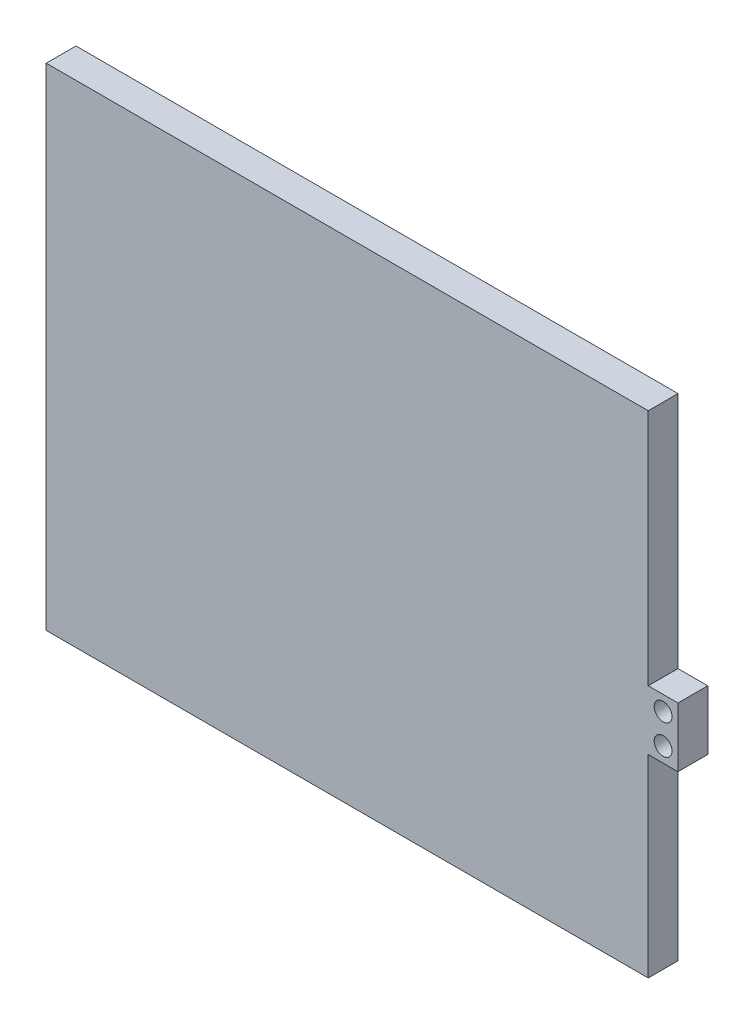
ISO-10303-21;
HEADER;
FILE_DESCRIPTION(('STEP AP214'),'2;1');
FILE_NAME('part.step','',(''),(''),'','','');
FILE_SCHEMA(('AUTOMOTIVE_DESIGN { 1 0 10303 214 1 1 1 1 }'));
ENDSEC;
DATA;
#1=APPLICATION_CONTEXT('core data for automotive mechanical design processes');
#2=APPLICATION_PROTOCOL_DEFINITION('international standard','automotive_design',2000,#1);
#3=PRODUCT_CONTEXT('',#1,'mechanical');
#4=PRODUCT('Part','Part','',(#3));
#5=PRODUCT_RELATED_PRODUCT_CATEGORY('part','',(#4));
#6=PRODUCT_DEFINITION_FORMATION('','',#4);
#7=PRODUCT_DEFINITION_CONTEXT('part definition',#1,'design');
#8=PRODUCT_DEFINITION('design','',#6,#7);
#9=PRODUCT_DEFINITION_SHAPE('','',#8);
#10=(LENGTH_UNIT() NAMED_UNIT(*) SI_UNIT(.MILLI.,.METRE.));
#11=(NAMED_UNIT(*) PLANE_ANGLE_UNIT() SI_UNIT($,.RADIAN.));
#12=(NAMED_UNIT(*) SI_UNIT($,.STERADIAN.) SOLID_ANGLE_UNIT());
#13=UNCERTAINTY_MEASURE_WITH_UNIT(LENGTH_MEASURE(1.E-05),#10,'distance_accuracy_value','');
#14=(GEOMETRIC_REPRESENTATION_CONTEXT(3) GLOBAL_UNCERTAINTY_ASSIGNED_CONTEXT((#13)) GLOBAL_UNIT_ASSIGNED_CONTEXT((#10,
#11,#12)) REPRESENTATION_CONTEXT('',''));
#15=CARTESIAN_POINT('',(0.,0.,0.));
#16=DIRECTION('',(0.,0.,1.));
#17=DIRECTION('',(1.,0.,0.));
#18=AXIS2_PLACEMENT_3D('',#15,#16,#17);
#19=CARTESIAN_POINT('',(134.372438209087,87.1772870662461,12.7));
#20=DIRECTION('',(-1.,0.,0.));
#21=DIRECTION('',(0.,0.,1.));
#22=AXIS2_PLACEMENT_3D('',#19,#20,#21);
#23=PLANE('',#22);
#24=DIRECTION('',(0.,0.,1.));
#25=VECTOR('',#24,1.);
#26=CARTESIAN_POINT('',(134.372438209087,-1.72271293375394,12.7));
#27=LINE('',#26,#25);
#28=CARTESIAN_POINT('',(134.372438209087,-1.72271293375394,0.));
#29=VERTEX_POINT('',#28);
#30=CARTESIAN_POINT('',(134.372438209087,-1.72271293375394,12.7));
#31=VERTEX_POINT('',#30);
#32=EDGE_CURVE('E147',#29,#31,#27,.T.);
#33=ORIENTED_EDGE('',*,*,#32,.F.);
#34=DIRECTION('',(0.,1.,0.));
#35=VECTOR('',#34,1.);
#36=CARTESIAN_POINT('',(134.372438209087,87.1772870662461,0.));
#37=LINE('',#36,#35);
#38=CARTESIAN_POINT('',(134.372438209087,99.8772870662461,0.));
#39=VERTEX_POINT('',#38);
#40=EDGE_CURVE('E173',#29,#39,#37,.T.);
#41=ORIENTED_EDGE('',*,*,#40,.T.);
#42=DIRECTION('',(0.,0.,-1.));
#43=VECTOR('',#42,1.);
#44=CARTESIAN_POINT('',(134.372438209087,99.8772870662461,0.));
#45=LINE('',#44,#43);
#46=CARTESIAN_POINT('',(134.372438209087,99.8772870662461,12.7));
#47=VERTEX_POINT('',#46);
#48=EDGE_CURVE('E121',#47,#39,#45,.T.);
#49=ORIENTED_EDGE('',*,*,#48,.F.);
#50=DIRECTION('',(0.,1.,0.));
#51=VECTOR('',#50,1.);
#52=CARTESIAN_POINT('',(134.372438209087,87.1772870662461,12.7));
#53=LINE('',#52,#51);
#54=EDGE_CURVE('E54',#31,#47,#53,.T.);
#55=ORIENTED_EDGE('',*,*,#54,.F.);
#56=EDGE_LOOP('',(#33,#41,#49,#55));
#57=FACE_BOUND('',#56,.T.);
#58=ADVANCED_FACE('F39',(#57),#23,.F.);
#59=DIRECTION('',(0.,0.,-1.));
#60=VECTOR('',#59,1.);
#61=CARTESIAN_POINT('',(134.372438209087,-27.1227129337539,12.7));
#62=LINE('',#61,#60);
#63=CARTESIAN_POINT('',(134.372438209087,-27.1227129337539,12.7));
#64=VERTEX_POINT('',#63);
#65=CARTESIAN_POINT('',(134.372438209087,-27.1227129337539,0.));
#66=VERTEX_POINT('',#65);
#67=EDGE_CURVE('E62',#64,#66,#62,.T.);
#68=ORIENTED_EDGE('',*,*,#67,.F.);
#69=CARTESIAN_POINT('',(134.372438209087,-109.672712933754,12.7));
#70=VERTEX_POINT('',#69);
#71=EDGE_CURVE('E168',#70,#64,#53,.T.);
#72=ORIENTED_EDGE('',*,*,#71,.F.);
#73=DIRECTION('',(0.,0.,-1.));
#74=VECTOR('',#73,1.);
#75=CARTESIAN_POINT('',(134.372438209087,-109.672712933754,12.7));
#76=LINE('',#75,#74);
#77=CARTESIAN_POINT('',(134.372438209087,-109.672712933754,0.));
#78=VERTEX_POINT('',#77);
#79=EDGE_CURVE('E47',#70,#78,#76,.T.);
#80=ORIENTED_EDGE('',*,*,#79,.T.);
#81=EDGE_CURVE('E113',#78,#66,#37,.T.);
#82=ORIENTED_EDGE('',*,*,#81,.T.);
#83=EDGE_LOOP('',(#68,#72,#80,#82));
#84=FACE_BOUND('',#83,.T.);
#85=ADVANCED_FACE('F177',(#84),#23,.F.);
#86=CARTESIAN_POINT('',(-122.421561790913,87.1772870662461,12.7));
#87=DIRECTION('',(1.,0.,0.));
#88=DIRECTION('',(0.,1.,0.));
#89=AXIS2_PLACEMENT_3D('',#86,#87,#88);
#90=PLANE('',#89);
#91=DIRECTION('',(0.,-1.,0.));
#92=VECTOR('',#91,1.);
#93=CARTESIAN_POINT('',(-122.421561790913,87.1772870662461,0.));
#94=LINE('',#93,#92);
#95=CARTESIAN_POINT('',(-122.421561790913,99.8772870662461,0.));
#96=VERTEX_POINT('',#95);
#97=CARTESIAN_POINT('',(-122.421561790913,-109.672712933754,0.));
#98=VERTEX_POINT('',#97);
#99=EDGE_CURVE('E165',#96,#98,#94,.T.);
#100=ORIENTED_EDGE('',*,*,#99,.T.);
#101=DIRECTION('',(0.,0.,-1.));
#102=VECTOR('',#101,1.);
#103=CARTESIAN_POINT('',(-122.421561790913,-109.672712933754,12.7));
#104=LINE('',#103,#102);
#105=CARTESIAN_POINT('',(-122.421561790913,-109.672712933754,12.7));
#106=VERTEX_POINT('',#105);
#107=EDGE_CURVE('E11',#106,#98,#104,.T.);
#108=ORIENTED_EDGE('',*,*,#107,.F.);
#109=DIRECTION('',(0.,-1.,0.));
#110=VECTOR('',#109,1.);
#111=CARTESIAN_POINT('',(-122.421561790913,87.1772870662461,12.7));
#112=LINE('',#111,#110);
#113=CARTESIAN_POINT('',(-122.421561790913,99.8772870662461,12.7));
#114=VERTEX_POINT('',#113);
#115=EDGE_CURVE('E106',#114,#106,#112,.T.);
#116=ORIENTED_EDGE('',*,*,#115,.F.);
#117=DIRECTION('',(0.,0.,1.));
#118=VECTOR('',#117,1.);
#119=CARTESIAN_POINT('',(-122.421561790913,99.8772870662461,0.));
#120=LINE('',#119,#118);
#121=EDGE_CURVE('E110',#96,#114,#120,.T.);
#122=ORIENTED_EDGE('',*,*,#121,.F.);
#123=EDGE_LOOP('',(#100,#108,#116,#122));
#124=FACE_BOUND('',#123,.T.);
#125=ADVANCED_FACE('F41',(#124),#90,.F.);
#126=CARTESIAN_POINT('',(-122.421561790913,-109.672712933754,12.7));
#127=DIRECTION('',(0.,1.,0.));
#128=DIRECTION('',(0.,0.,1.));
#129=AXIS2_PLACEMENT_3D('',#126,#127,#128);
#130=PLANE('',#129);
#131=DIRECTION('',(1.,0.,0.));
#132=VECTOR('',#131,1.);
#133=CARTESIAN_POINT('',(-122.421561790913,-109.672712933754,0.));
#134=LINE('',#133,#132);
#135=EDGE_CURVE('E171',#98,#78,#134,.T.);
#136=ORIENTED_EDGE('',*,*,#135,.T.);
#137=ORIENTED_EDGE('',*,*,#79,.F.);
#138=DIRECTION('',(1.,0.,0.));
#139=VECTOR('',#138,1.);
#140=CARTESIAN_POINT('',(-122.421561790913,-109.672712933754,12.7));
#141=LINE('',#140,#139);
#142=EDGE_CURVE('E112',#106,#70,#141,.T.);
#143=ORIENTED_EDGE('',*,*,#142,.F.);
#144=ORIENTED_EDGE('',*,*,#107,.T.);
#145=EDGE_LOOP('',(#136,#137,#143,#144));
#146=FACE_BOUND('',#145,.T.);
#147=ADVANCED_FACE('F188',(#146),#130,.F.);
#148=CARTESIAN_POINT('',(0.,0.,12.7));
#149=DIRECTION('',(0.,0.,1.));
#150=DIRECTION('',(1.,0.,0.));
#151=AXIS2_PLACEMENT_3D('',#148,#149,#150);
#152=PLANE('',#151);
#153=CARTESIAN_POINT('',(140.722438209087,-8.07271293375394,12.7));
#154=DIRECTION('',(0.,0.,-1.));
#155=DIRECTION('',(-1.,0.,0.));
#156=AXIS2_PLACEMENT_3D('',#153,#154,#155);
#157=CIRCLE('',#156,3.81000000000001);
#158=CARTESIAN_POINT('',(136.912438209087,-8.07271293375394,12.7));
#159=VERTEX_POINT('',#158);
#160=EDGE_CURVE('E132',#159,#159,#157,.T.);
#161=ORIENTED_EDGE('',*,*,#160,.T.);
#162=EDGE_LOOP('',(#161));
#163=FACE_BOUND('',#162,.T.);
#164=CARTESIAN_POINT('',(140.722438209087,-20.7727129337539,12.7));
#165=DIRECTION('',(0.,0.,-1.));
#166=DIRECTION('',(-1.,0.,0.));
#167=AXIS2_PLACEMENT_3D('',#164,#165,#166);
#168=CIRCLE('',#167,3.81000000000001);
#169=CARTESIAN_POINT('',(136.912438209087,-20.7727129337539,12.7));
#170=VERTEX_POINT('',#169);
#171=EDGE_CURVE('E131',#170,#170,#168,.T.);
#172=ORIENTED_EDGE('',*,*,#171,.T.);
#173=EDGE_LOOP('',(#172));
#174=FACE_BOUND('',#173,.T.);
#175=ORIENTED_EDGE('',*,*,#115,.T.);
#176=ORIENTED_EDGE('',*,*,#142,.T.);
#177=ORIENTED_EDGE('',*,*,#71,.T.);
#178=DIRECTION('',(-1.,0.,0.));
#179=VECTOR('',#178,1.);
#180=CARTESIAN_POINT('',(147.072438209087,-27.1227129337539,12.7));
#181=LINE('',#180,#179);
#182=CARTESIAN_POINT('',(147.072438209087,-27.1227129337539,12.7));
#183=VERTEX_POINT('',#182);
#184=EDGE_CURVE('E163',#183,#64,#181,.T.);
#185=ORIENTED_EDGE('',*,*,#184,.F.);
#186=DIRECTION('',(0.,-1.,0.));
#187=VECTOR('',#186,1.);
#188=CARTESIAN_POINT('',(147.072438209087,-1.72271293375394,12.7));
#189=LINE('',#188,#187);
#190=CARTESIAN_POINT('',(147.072438209087,-1.72271293375394,12.7));
#191=VERTEX_POINT('',#190);
#192=EDGE_CURVE('E143',#191,#183,#189,.T.);
#193=ORIENTED_EDGE('',*,*,#192,.F.);
#194=DIRECTION('',(-1.,0.,0.));
#195=VECTOR('',#194,1.);
#196=CARTESIAN_POINT('',(147.072438209087,-1.72271293375394,12.7));
#197=LINE('',#196,#195);
#198=EDGE_CURVE('E153',#191,#31,#197,.T.);
#199=ORIENTED_EDGE('',*,*,#198,.T.);
#200=ORIENTED_EDGE('',*,*,#54,.T.);
#201=DIRECTION('',(1.,0.,0.));
#202=VECTOR('',#201,1.);
#203=CARTESIAN_POINT('',(-122.421561790913,99.8772870662461,12.7));
#204=LINE('',#203,#202);
#205=EDGE_CURVE('E116',#114,#47,#204,.T.);
#206=ORIENTED_EDGE('',*,*,#205,.F.);
#207=EDGE_LOOP('',(#175,#176,#177,#185,#193,#199,#200,#206));
#208=FACE_BOUND('',#207,.T.);
#209=ADVANCED_FACE('F117',(#163,#174,#208),#152,.T.);
#210=CARTESIAN_POINT('',(0.,0.,0.));
#211=DIRECTION('',(0.,0.,1.));
#212=DIRECTION('',(1.,0.,0.));
#213=AXIS2_PLACEMENT_3D('',#210,#211,#212);
#214=PLANE('',#213);
#215=CARTESIAN_POINT('',(140.722438209087,-8.07271293375394,0.));
#216=DIRECTION('',(0.,0.,-1.));
#217=DIRECTION('',(-1.,0.,0.));
#218=AXIS2_PLACEMENT_3D('',#215,#216,#217);
#219=CIRCLE('',#218,3.81000000000001);
#220=CARTESIAN_POINT('',(136.912438209087,-8.07271293375394,0.));
#221=VERTEX_POINT('',#220);
#222=EDGE_CURVE('E135',#221,#221,#219,.T.);
#223=ORIENTED_EDGE('',*,*,#222,.F.);
#224=EDGE_LOOP('',(#223));
#225=FACE_BOUND('',#224,.T.);
#226=CARTESIAN_POINT('',(140.722438209087,-20.7727129337539,0.));
#227=DIRECTION('',(0.,0.,-1.));
#228=DIRECTION('',(-1.,0.,0.));
#229=AXIS2_PLACEMENT_3D('',#226,#227,#228);
#230=CIRCLE('',#229,3.81000000000001);
#231=CARTESIAN_POINT('',(136.912438209087,-20.7727129337539,0.));
#232=VERTEX_POINT('',#231);
#233=EDGE_CURVE('E138',#232,#232,#230,.T.);
#234=ORIENTED_EDGE('',*,*,#233,.F.);
#235=EDGE_LOOP('',(#234));
#236=FACE_BOUND('',#235,.T.);
#237=ORIENTED_EDGE('',*,*,#99,.F.);
#238=DIRECTION('',(-1.,0.,0.));
#239=VECTOR('',#238,1.);
#240=CARTESIAN_POINT('',(-122.421561790913,99.8772870662461,0.));
#241=LINE('',#240,#239);
#242=EDGE_CURVE('E126',#39,#96,#241,.T.);
#243=ORIENTED_EDGE('',*,*,#242,.F.);
#244=ORIENTED_EDGE('',*,*,#40,.F.);
#245=DIRECTION('',(-1.,0.,0.));
#246=VECTOR('',#245,1.);
#247=CARTESIAN_POINT('',(147.072438209087,-1.72271293375394,0.));
#248=LINE('',#247,#246);
#249=CARTESIAN_POINT('',(147.072438209087,-1.72271293375394,0.));
#250=VERTEX_POINT('',#249);
#251=EDGE_CURVE('E157',#250,#29,#248,.T.);
#252=ORIENTED_EDGE('',*,*,#251,.F.);
#253=DIRECTION('',(0.,1.,0.));
#254=VECTOR('',#253,1.);
#255=CARTESIAN_POINT('',(147.072438209087,-1.72271293375394,0.));
#256=LINE('',#255,#254);
#257=CARTESIAN_POINT('',(147.072438209087,-27.1227129337539,0.));
#258=VERTEX_POINT('',#257);
#259=EDGE_CURVE('E149',#258,#250,#256,.T.);
#260=ORIENTED_EDGE('',*,*,#259,.F.);
#261=DIRECTION('',(-1.,0.,0.));
#262=VECTOR('',#261,1.);
#263=CARTESIAN_POINT('',(147.072438209087,-27.1227129337539,0.));
#264=LINE('',#263,#262);
#265=EDGE_CURVE('E160',#258,#66,#264,.T.);
#266=ORIENTED_EDGE('',*,*,#265,.T.);
#267=ORIENTED_EDGE('',*,*,#81,.F.);
#268=ORIENTED_EDGE('',*,*,#135,.F.);
#269=EDGE_LOOP('',(#237,#243,#244,#252,#260,#266,#267,#268));
#270=FACE_BOUND('',#269,.T.);
#271=ADVANCED_FACE('F180',(#225,#236,#270),#214,.F.);
#272=CARTESIAN_POINT('',(147.072438209087,-27.1227129337539,12.7));
#273=DIRECTION('',(0.,1.,0.));
#274=DIRECTION('',(0.,0.,1.));
#275=AXIS2_PLACEMENT_3D('',#272,#273,#274);
#276=PLANE('',#275);
#277=ORIENTED_EDGE('',*,*,#67,.T.);
#278=ORIENTED_EDGE('',*,*,#265,.F.);
#279=DIRECTION('',(0.,0.,-1.));
#280=VECTOR('',#279,1.);
#281=CARTESIAN_POINT('',(147.072438209087,-27.1227129337539,12.7));
#282=LINE('',#281,#280);
#283=EDGE_CURVE('E146',#183,#258,#282,.T.);
#284=ORIENTED_EDGE('',*,*,#283,.F.);
#285=ORIENTED_EDGE('',*,*,#184,.T.);
#286=EDGE_LOOP('',(#277,#278,#284,#285));
#287=FACE_BOUND('',#286,.T.);
#288=ADVANCED_FACE('F185',(#287),#276,.F.);
#289=CARTESIAN_POINT('',(147.072438209087,-1.72271293375394,12.7));
#290=DIRECTION('',(0.,-1.,0.));
#291=DIRECTION('',(0.,0.,-1.));
#292=AXIS2_PLACEMENT_3D('',#289,#290,#291);
#293=PLANE('',#292);
#294=ORIENTED_EDGE('',*,*,#32,.T.);
#295=ORIENTED_EDGE('',*,*,#198,.F.);
#296=DIRECTION('',(0.,0.,1.));
#297=VECTOR('',#296,1.);
#298=CARTESIAN_POINT('',(147.072438209087,-1.72271293375394,12.7));
#299=LINE('',#298,#297);
#300=EDGE_CURVE('E151',#250,#191,#299,.T.);
#301=ORIENTED_EDGE('',*,*,#300,.F.);
#302=ORIENTED_EDGE('',*,*,#251,.T.);
#303=EDGE_LOOP('',(#294,#295,#301,#302));
#304=FACE_BOUND('',#303,.T.);
#305=ADVANCED_FACE('F192',(#304),#293,.F.);
#306=CARTESIAN_POINT('',(147.072438209087,0.,0.));
#307=DIRECTION('',(1.,0.,0.));
#308=DIRECTION('',(0.,0.,-1.));
#309=AXIS2_PLACEMENT_3D('',#306,#307,#308);
#310=PLANE('',#309);
#311=ORIENTED_EDGE('',*,*,#192,.T.);
#312=ORIENTED_EDGE('',*,*,#283,.T.);
#313=ORIENTED_EDGE('',*,*,#259,.T.);
#314=ORIENTED_EDGE('',*,*,#300,.T.);
#315=EDGE_LOOP('',(#311,#312,#313,#314));
#316=FACE_BOUND('',#315,.T.);
#317=ADVANCED_FACE('F195',(#316),#310,.T.);
#318=CARTESIAN_POINT('',(140.722438209087,-20.7727129337539,12.7));
#319=DIRECTION('',(0.,0.,-1.));
#320=DIRECTION('',(-1.,0.,0.));
#321=AXIS2_PLACEMENT_3D('',#318,#319,#320);
#322=CYLINDRICAL_SURFACE('',#321,3.81000000000001);
#323=ORIENTED_EDGE('',*,*,#171,.F.);
#324=EDGE_LOOP('',(#323));
#325=FACE_BOUND('',#324,.T.);
#326=ORIENTED_EDGE('',*,*,#233,.T.);
#327=EDGE_LOOP('',(#326));
#328=FACE_BOUND('',#327,.T.);
#329=ADVANCED_FACE('F197',(#325,#328),#322,.F.);
#330=CARTESIAN_POINT('',(140.722438209087,-8.07271293375394,12.7));
#331=DIRECTION('',(0.,0.,-1.));
#332=DIRECTION('',(-1.,0.,0.));
#333=AXIS2_PLACEMENT_3D('',#330,#331,#332);
#334=CYLINDRICAL_SURFACE('',#333,3.81000000000001);
#335=ORIENTED_EDGE('',*,*,#160,.F.);
#336=EDGE_LOOP('',(#335));
#337=FACE_BOUND('',#336,.T.);
#338=ORIENTED_EDGE('',*,*,#222,.T.);
#339=EDGE_LOOP('',(#338));
#340=FACE_BOUND('',#339,.T.);
#341=ADVANCED_FACE('F203',(#337,#340),#334,.F.);
#342=CARTESIAN_POINT('',(0.,99.8772870662461,0.));
#343=DIRECTION('',(0.,1.,0.));
#344=DIRECTION('',(0.,0.,1.));
#345=AXIS2_PLACEMENT_3D('',#342,#343,#344);
#346=PLANE('',#345);
#347=ORIENTED_EDGE('',*,*,#121,.T.);
#348=ORIENTED_EDGE('',*,*,#205,.T.);
#349=ORIENTED_EDGE('',*,*,#48,.T.);
#350=ORIENTED_EDGE('',*,*,#242,.T.);
#351=EDGE_LOOP('',(#347,#348,#349,#350));
#352=FACE_BOUND('',#351,.T.);
#353=ADVANCED_FACE('F124',(#352),#346,.T.);
#354=CLOSED_SHELL('',(#58,#85,#125,#147,#209,#271,#288,#305,#317,#329,#341,#353));
#355=MANIFOLD_SOLID_BREP('B2',#354);
#356=ADVANCED_BREP_SHAPE_REPRESENTATION('',(#18,#355),#14);
#357=SHAPE_DEFINITION_REPRESENTATION(#9,#356);
ENDSEC;
END-ISO-10303-21;
